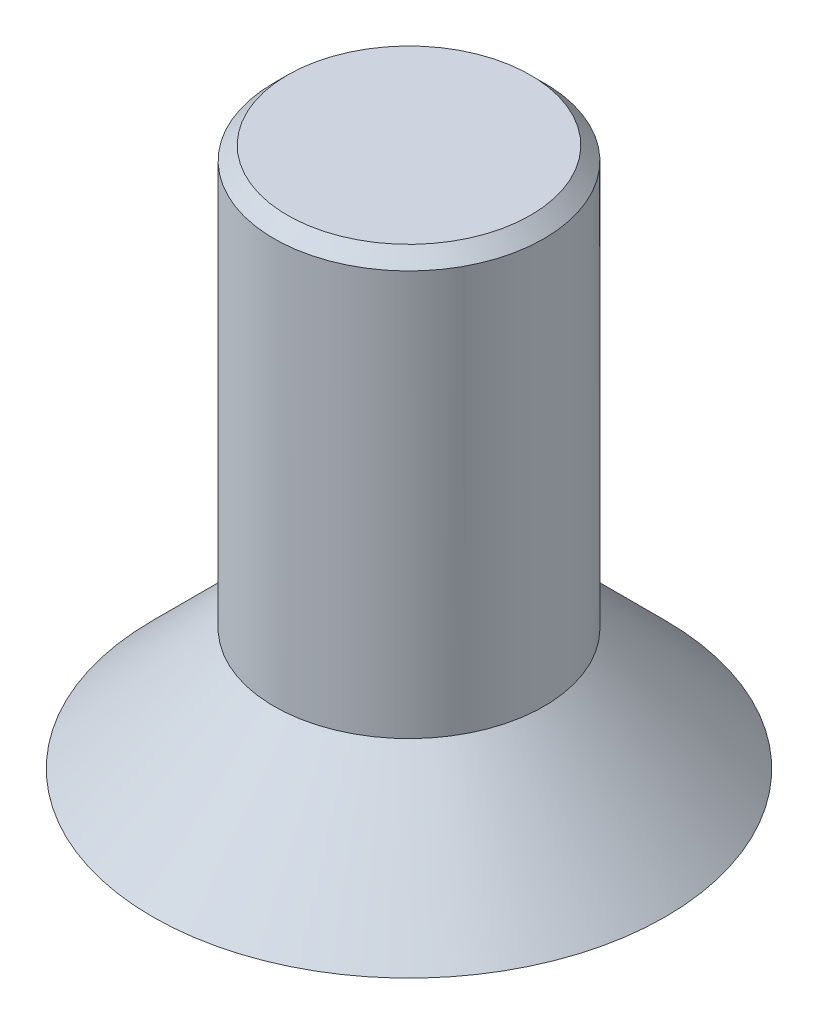
ISO-10303-21;
HEADER;
FILE_DESCRIPTION(('STEP AP214'),'2;1');
FILE_NAME('part.step','',(''),(''),'','','');
FILE_SCHEMA(('AUTOMOTIVE_DESIGN { 1 0 10303 214 1 1 1 1 }'));
ENDSEC;
DATA;
#1=APPLICATION_CONTEXT('core data for automotive mechanical design processes');
#2=APPLICATION_PROTOCOL_DEFINITION('international standard','automotive_design',2000,#1);
#3=PRODUCT_CONTEXT('',#1,'mechanical');
#4=PRODUCT('Part','Part','',(#3));
#5=PRODUCT_RELATED_PRODUCT_CATEGORY('part','',(#4));
#6=PRODUCT_DEFINITION_FORMATION('','',#4);
#7=PRODUCT_DEFINITION_CONTEXT('part definition',#1,'design');
#8=PRODUCT_DEFINITION('design','',#6,#7);
#9=PRODUCT_DEFINITION_SHAPE('','',#8);
#10=(LENGTH_UNIT() NAMED_UNIT(*) SI_UNIT(.MILLI.,.METRE.));
#11=(NAMED_UNIT(*) PLANE_ANGLE_UNIT() SI_UNIT($,.RADIAN.));
#12=(NAMED_UNIT(*) SI_UNIT($,.STERADIAN.) SOLID_ANGLE_UNIT());
#13=UNCERTAINTY_MEASURE_WITH_UNIT(LENGTH_MEASURE(1.E-05),#10,'distance_accuracy_value','');
#14=(GEOMETRIC_REPRESENTATION_CONTEXT(3) GLOBAL_UNCERTAINTY_ASSIGNED_CONTEXT((#13)) GLOBAL_UNIT_ASSIGNED_CONTEXT((#10,
#11,#12)) REPRESENTATION_CONTEXT('',''));
#15=CARTESIAN_POINT('',(0.,0.,0.));
#16=DIRECTION('',(0.,0.,1.));
#17=DIRECTION('',(1.,0.,0.));
#18=AXIS2_PLACEMENT_3D('',#15,#16,#17);
#19=CARTESIAN_POINT('',(0.,0.,0.));
#20=DIRECTION('',(0.,1.,0.));
#21=DIRECTION('',(-1.,0.,0.));
#22=AXIS2_PLACEMENT_3D('',#19,#20,#21);
#23=PLANE('',#22);
#24=DIRECTION('',(-0.012738667916744,0.,0.999918859877994));
#25=VECTOR('',#24,1.);
#26=CARTESIAN_POINT('',(0.755455149921632,0.,-0.423423566251199));
#27=LINE('',#26,#25);
#28=CARTESIAN_POINT('',(0.755455149921632,0.,-0.423423566251199));
#29=VERTEX_POINT('',#28);
#30=CARTESIAN_POINT('',(0.744423139895358,0.,0.442531568126316));
#31=VERTEX_POINT('',#30);
#32=EDGE_CURVE('E124',#29,#31,#27,.T.);
#33=ORIENTED_EDGE('',*,*,#32,.F.);
#34=DIRECTION('',(0.859585800419143,0.,0.510991439965271));
#35=VECTOR('',#34,1.);
#36=CARTESIAN_POINT('',(0.0110320100262732,0.,-0.865955134377515));
#37=LINE('',#36,#35);
#38=CARTESIAN_POINT('',(0.0110320100262732,0.,-0.865955134377515));
#39=VERTEX_POINT('',#38);
#40=EDGE_CURVE('E50',#39,#29,#37,.T.);
#41=ORIENTED_EDGE('',*,*,#40,.F.);
#42=DIRECTION('',(0.872324468335887,0.,-0.488927419912723));
#43=VECTOR('',#42,1.);
#44=CARTESIAN_POINT('',(-0.744423139895358,0.,-0.442531568126316));
#45=LINE('',#44,#43);
#46=CARTESIAN_POINT('',(-0.744423139895358,0.,-0.442531568126316));
#47=VERTEX_POINT('',#46);
#48=EDGE_CURVE('E133',#47,#39,#45,.T.);
#49=ORIENTED_EDGE('',*,*,#48,.F.);
#50=DIRECTION('',(0.0127386679167445,0.,-0.999918859877994));
#51=VECTOR('',#50,1.);
#52=CARTESIAN_POINT('',(-0.755455149921633,0.,0.423423566251199));
#53=LINE('',#52,#51);
#54=CARTESIAN_POINT('',(-0.755455149921633,0.,0.423423566251199));
#55=VERTEX_POINT('',#54);
#56=EDGE_CURVE('E131',#55,#47,#53,.T.);
#57=ORIENTED_EDGE('',*,*,#56,.F.);
#58=DIRECTION('',(-0.859585800419143,0.,-0.510991439965271));
#59=VECTOR('',#58,1.);
#60=CARTESIAN_POINT('',(-0.0110320100262739,0.,0.865955134377515));
#61=LINE('',#60,#59);
#62=CARTESIAN_POINT('',(-0.0110320100262739,0.,0.865955134377515));
#63=VERTEX_POINT('',#62);
#64=EDGE_CURVE('E98',#63,#55,#61,.T.);
#65=ORIENTED_EDGE('',*,*,#64,.F.);
#66=DIRECTION('',(-0.872324468335887,0.,0.488927419912723));
#67=VECTOR('',#66,1.);
#68=CARTESIAN_POINT('',(0.744423139895358,0.,0.442531568126316));
#69=LINE('',#68,#67);
#70=EDGE_CURVE('E127',#31,#63,#69,.T.);
#71=ORIENTED_EDGE('',*,*,#70,.F.);
#72=EDGE_LOOP('',(#33,#41,#49,#57,#65,#71));
#73=FACE_BOUND('',#72,.T.);
#74=CARTESIAN_POINT('',(0.,0.,0.));
#75=DIRECTION('',(0.,1.,0.));
#76=DIRECTION('',(-1.,0.,0.));
#77=AXIS2_PLACEMENT_3D('',#74,#75,#76);
#78=CIRCLE('',#77,1.9);
#79=CARTESIAN_POINT('',(-1.9,0.,0.));
#80=VERTEX_POINT('',#79);
#81=EDGE_CURVE('E145',#80,#80,#78,.T.);
#82=ORIENTED_EDGE('',*,*,#81,.F.);
#83=EDGE_LOOP('',(#82));
#84=FACE_BOUND('',#83,.T.);
#85=ADVANCED_FACE('F34',(#73,#84),#23,.F.);
#86=CARTESIAN_POINT('',(0.,0.,0.));
#87=DIRECTION('',(0.,-1.,0.));
#88=DIRECTION('',(1.,0.,0.));
#89=AXIS2_PLACEMENT_3D('',#86,#87,#88);
#90=CONICAL_SURFACE('',#89,1.9,0.785398163397454);
#91=CARTESIAN_POINT('',(0.,0.89999999999999,0.));
#92=DIRECTION('',(0.,1.,0.));
#93=DIRECTION('',(-1.,0.,0.));
#94=AXIS2_PLACEMENT_3D('',#91,#92,#93);
#95=CIRCLE('',#94,1.);
#96=CARTESIAN_POINT('',(-1.,0.89999999999999,0.));
#97=VERTEX_POINT('',#96);
#98=EDGE_CURVE('E137',#97,#97,#95,.T.);
#99=ORIENTED_EDGE('',*,*,#98,.F.);
#100=EDGE_LOOP('',(#99));
#101=FACE_BOUND('',#100,.T.);
#102=ORIENTED_EDGE('',*,*,#81,.T.);
#103=EDGE_LOOP('',(#102));
#104=FACE_BOUND('',#103,.T.);
#105=ADVANCED_FACE('F161',(#101,#104),#90,.T.);
#106=CARTESIAN_POINT('',(0.,4.,0.));
#107=DIRECTION('',(0.,1.,0.));
#108=DIRECTION('',(-1.,0.,0.));
#109=AXIS2_PLACEMENT_3D('',#106,#107,#108);
#110=CYLINDRICAL_SURFACE('',#109,1.);
#111=CARTESIAN_POINT('',(0.,3.9,0.));
#112=DIRECTION('',(0.,-1.,0.));
#113=DIRECTION('',(1.,0.,0.));
#114=AXIS2_PLACEMENT_3D('',#111,#112,#113);
#115=CIRCLE('',#114,1.);
#116=CARTESIAN_POINT('',(1.,3.9,0.));
#117=VERTEX_POINT('',#116);
#118=EDGE_CURVE('E11',#117,#117,#115,.T.);
#119=ORIENTED_EDGE('',*,*,#118,.T.);
#120=EDGE_LOOP('',(#119));
#121=FACE_BOUND('',#120,.T.);
#122=ORIENTED_EDGE('',*,*,#98,.T.);
#123=EDGE_LOOP('',(#122));
#124=FACE_BOUND('',#123,.T.);
#125=ADVANCED_FACE('F166',(#121,#124),#110,.T.);
#126=CARTESIAN_POINT('',(1.,4.,0.));
#127=DIRECTION('',(0.,-1.,0.));
#128=DIRECTION('',(1.,0.,0.));
#129=AXIS2_PLACEMENT_3D('',#126,#127,#128);
#130=PLANE('',#129);
#131=CARTESIAN_POINT('',(0.,4.,0.));
#132=DIRECTION('',(0.,-1.,0.));
#133=DIRECTION('',(1.,0.,0.));
#134=AXIS2_PLACEMENT_3D('',#131,#132,#133);
#135=CIRCLE('',#134,0.9);
#136=CARTESIAN_POINT('',(0.9,4.,0.));
#137=VERTEX_POINT('',#136);
#138=EDGE_CURVE('E43',#137,#137,#135,.F.);
#139=ORIENTED_EDGE('',*,*,#138,.T.);
#140=EDGE_LOOP('',(#139));
#141=FACE_BOUND('',#140,.T.);
#142=ADVANCED_FACE('F150',(#141),#130,.F.);
#143=CARTESIAN_POINT('',(0.0110320100262732,1.,-0.865955134377515));
#144=DIRECTION('',(0.510991439965271,0.,-0.859585800419143));
#145=DIRECTION('',(-0.859585800419143,0.,-0.510991439965271));
#146=AXIS2_PLACEMENT_3D('',#143,#144,#145);
#147=PLANE('',#146);
#148=ORIENTED_EDGE('',*,*,#40,.T.);
#149=DIRECTION('',(0.,-1.,0.));
#150=VECTOR('',#149,1.);
#151=CARTESIAN_POINT('',(0.755455149921632,1.,-0.423423566251199));
#152=LINE('',#151,#150);
#153=CARTESIAN_POINT('',(0.755455149921632,1.,-0.423423566251199));
#154=VERTEX_POINT('',#153);
#155=EDGE_CURVE('E80',#154,#29,#152,.T.);
#156=ORIENTED_EDGE('',*,*,#155,.F.);
#157=DIRECTION('',(0.859585800419143,0.,0.510991439965271));
#158=VECTOR('',#157,1.);
#159=CARTESIAN_POINT('',(0.0110320100262732,1.,-0.865955134377515));
#160=LINE('',#159,#158);
#161=CARTESIAN_POINT('',(0.0110320100262732,1.,-0.865955134377515));
#162=VERTEX_POINT('',#161);
#163=EDGE_CURVE('E135',#162,#154,#160,.T.);
#164=ORIENTED_EDGE('',*,*,#163,.F.);
#165=DIRECTION('',(0.,-1.,0.));
#166=VECTOR('',#165,1.);
#167=CARTESIAN_POINT('',(0.0110320100262732,1.,-0.865955134377515));
#168=LINE('',#167,#166);
#169=EDGE_CURVE('E58',#162,#39,#168,.T.);
#170=ORIENTED_EDGE('',*,*,#169,.T.);
#171=EDGE_LOOP('',(#148,#156,#164,#170));
#172=FACE_BOUND('',#171,.T.);
#173=ADVANCED_FACE('F177',(#172),#147,.F.);
#174=CARTESIAN_POINT('',(-0.744423139895358,1.,-0.442531568126316));
#175=DIRECTION('',(-0.488927419912723,0.,-0.872324468335887));
#176=DIRECTION('',(-0.872324468335887,0.,0.488927419912723));
#177=AXIS2_PLACEMENT_3D('',#174,#175,#176);
#178=PLANE('',#177);
#179=ORIENTED_EDGE('',*,*,#48,.T.);
#180=ORIENTED_EDGE('',*,*,#169,.F.);
#181=DIRECTION('',(0.872324468335887,0.,-0.488927419912723));
#182=VECTOR('',#181,1.);
#183=CARTESIAN_POINT('',(-0.744423139895358,1.,-0.442531568126316));
#184=LINE('',#183,#182);
#185=CARTESIAN_POINT('',(-0.744423139895358,1.,-0.442531568126316));
#186=VERTEX_POINT('',#185);
#187=EDGE_CURVE('E110',#186,#162,#184,.T.);
#188=ORIENTED_EDGE('',*,*,#187,.F.);
#189=DIRECTION('',(0.,-1.,0.));
#190=VECTOR('',#189,1.);
#191=CARTESIAN_POINT('',(-0.744423139895358,1.,-0.442531568126316));
#192=LINE('',#191,#190);
#193=EDGE_CURVE('E102',#186,#47,#192,.T.);
#194=ORIENTED_EDGE('',*,*,#193,.T.);
#195=EDGE_LOOP('',(#179,#180,#188,#194));
#196=FACE_BOUND('',#195,.T.);
#197=ADVANCED_FACE('F180',(#196),#178,.F.);
#198=CARTESIAN_POINT('',(-0.755455149921633,1.,0.423423566251199));
#199=DIRECTION('',(-0.999918859877994,0.,-0.0127386679167445));
#200=DIRECTION('',(-0.0127386679167445,0.,0.999918859877994));
#201=AXIS2_PLACEMENT_3D('',#198,#199,#200);
#202=PLANE('',#201);
#203=ORIENTED_EDGE('',*,*,#56,.T.);
#204=ORIENTED_EDGE('',*,*,#193,.F.);
#205=DIRECTION('',(0.0127386679167445,0.,-0.999918859877994));
#206=VECTOR('',#205,1.);
#207=CARTESIAN_POINT('',(-0.755455149921633,1.,0.423423566251199));
#208=LINE('',#207,#206);
#209=CARTESIAN_POINT('',(-0.755455149921633,1.,0.423423566251199));
#210=VERTEX_POINT('',#209);
#211=EDGE_CURVE('E106',#210,#186,#208,.T.);
#212=ORIENTED_EDGE('',*,*,#211,.F.);
#213=DIRECTION('',(0.,-1.,0.));
#214=VECTOR('',#213,1.);
#215=CARTESIAN_POINT('',(-0.755455149921633,1.,0.423423566251199));
#216=LINE('',#215,#214);
#217=EDGE_CURVE('E91',#210,#55,#216,.T.);
#218=ORIENTED_EDGE('',*,*,#217,.T.);
#219=EDGE_LOOP('',(#203,#204,#212,#218));
#220=FACE_BOUND('',#219,.T.);
#221=ADVANCED_FACE('F107',(#220),#202,.F.);
#222=CARTESIAN_POINT('',(-0.0110320100262739,1.,0.865955134377515));
#223=DIRECTION('',(-0.510991439965271,0.,0.859585800419143));
#224=DIRECTION('',(0.859585800419143,0.,0.510991439965271));
#225=AXIS2_PLACEMENT_3D('',#222,#223,#224);
#226=PLANE('',#225);
#227=ORIENTED_EDGE('',*,*,#64,.T.);
#228=ORIENTED_EDGE('',*,*,#217,.F.);
#229=DIRECTION('',(-0.859585800419143,0.,-0.510991439965271));
#230=VECTOR('',#229,1.);
#231=CARTESIAN_POINT('',(-0.0110320100262739,1.,0.865955134377515));
#232=LINE('',#231,#230);
#233=CARTESIAN_POINT('',(-0.0110320100262739,1.,0.865955134377515));
#234=VERTEX_POINT('',#233);
#235=EDGE_CURVE('E95',#234,#210,#232,.T.);
#236=ORIENTED_EDGE('',*,*,#235,.F.);
#237=DIRECTION('',(0.,-1.,0.));
#238=VECTOR('',#237,1.);
#239=CARTESIAN_POINT('',(-0.0110320100262739,1.,0.865955134377515));
#240=LINE('',#239,#238);
#241=EDGE_CURVE('E103',#234,#63,#240,.T.);
#242=ORIENTED_EDGE('',*,*,#241,.T.);
#243=EDGE_LOOP('',(#227,#228,#236,#242));
#244=FACE_BOUND('',#243,.T.);
#245=ADVANCED_FACE('F93',(#244),#226,.F.);
#246=CARTESIAN_POINT('',(0.744423139895358,1.,0.442531568126316));
#247=DIRECTION('',(0.488927419912723,0.,0.872324468335887));
#248=DIRECTION('',(0.872324468335887,0.,-0.488927419912723));
#249=AXIS2_PLACEMENT_3D('',#246,#247,#248);
#250=PLANE('',#249);
#251=ORIENTED_EDGE('',*,*,#70,.T.);
#252=ORIENTED_EDGE('',*,*,#241,.F.);
#253=DIRECTION('',(-0.872324468335887,0.,0.488927419912723));
#254=VECTOR('',#253,1.);
#255=CARTESIAN_POINT('',(0.744423139895358,1.,0.442531568126316));
#256=LINE('',#255,#254);
#257=CARTESIAN_POINT('',(0.744423139895358,1.,0.442531568126316));
#258=VERTEX_POINT('',#257);
#259=EDGE_CURVE('E116',#258,#234,#256,.T.);
#260=ORIENTED_EDGE('',*,*,#259,.F.);
#261=DIRECTION('',(0.,-1.,0.));
#262=VECTOR('',#261,1.);
#263=CARTESIAN_POINT('',(0.744423139895358,1.,0.442531568126316));
#264=LINE('',#263,#262);
#265=EDGE_CURVE('E140',#258,#31,#264,.T.);
#266=ORIENTED_EDGE('',*,*,#265,.T.);
#267=EDGE_LOOP('',(#251,#252,#260,#266));
#268=FACE_BOUND('',#267,.T.);
#269=ADVANCED_FACE('F183',(#268),#250,.F.);
#270=CARTESIAN_POINT('',(0.755455149921632,1.,-0.423423566251199));
#271=DIRECTION('',(0.999918859877994,0.,0.012738667916744));
#272=DIRECTION('',(0.012738667916744,0.,-0.999918859877994));
#273=AXIS2_PLACEMENT_3D('',#270,#271,#272);
#274=PLANE('',#273);
#275=ORIENTED_EDGE('',*,*,#32,.T.);
#276=ORIENTED_EDGE('',*,*,#265,.F.);
#277=DIRECTION('',(-0.012738667916744,0.,0.999918859877994));
#278=VECTOR('',#277,1.);
#279=CARTESIAN_POINT('',(0.755455149921632,1.,-0.423423566251199));
#280=LINE('',#279,#278);
#281=EDGE_CURVE('E118',#154,#258,#280,.T.);
#282=ORIENTED_EDGE('',*,*,#281,.F.);
#283=ORIENTED_EDGE('',*,*,#155,.T.);
#284=EDGE_LOOP('',(#275,#276,#282,#283));
#285=FACE_BOUND('',#284,.T.);
#286=ADVANCED_FACE('F157',(#285),#274,.F.);
#287=CARTESIAN_POINT('',(0.,1.,0.));
#288=DIRECTION('',(0.,-1.,0.));
#289=DIRECTION('',(1.,0.,0.));
#290=AXIS2_PLACEMENT_3D('',#287,#288,#289);
#291=PLANE('',#290);
#292=ORIENTED_EDGE('',*,*,#163,.T.);
#293=ORIENTED_EDGE('',*,*,#281,.T.);
#294=ORIENTED_EDGE('',*,*,#259,.T.);
#295=ORIENTED_EDGE('',*,*,#235,.T.);
#296=ORIENTED_EDGE('',*,*,#211,.T.);
#297=ORIENTED_EDGE('',*,*,#187,.T.);
#298=EDGE_LOOP('',(#292,#293,#294,#295,#296,#297));
#299=FACE_BOUND('',#298,.T.);
#300=ADVANCED_FACE('F113',(#299),#291,.T.);
#301=CARTESIAN_POINT('',(0.,4.,0.));
#302=DIRECTION('',(0.,-1.,0.));
#303=DIRECTION('',(1.,0.,0.));
#304=AXIS2_PLACEMENT_3D('',#301,#302,#303);
#305=CONICAL_SURFACE('',#304,0.9,0.78539816339744);
#306=ORIENTED_EDGE('',*,*,#118,.F.);
#307=EDGE_LOOP('',(#306));
#308=FACE_BOUND('',#307,.T.);
#309=ORIENTED_EDGE('',*,*,#138,.F.);
#310=EDGE_LOOP('',(#309));
#311=FACE_BOUND('',#310,.T.);
#312=ADVANCED_FACE('F37',(#308,#311),#305,.T.);
#313=CLOSED_SHELL('',(#85,#105,#125,#142,#173,#197,#221,#245,#269,#286,#300,#312));
#314=MANIFOLD_SOLID_BREP('B2',#313);
#315=ADVANCED_BREP_SHAPE_REPRESENTATION('',(#18,#314),#14);
#316=SHAPE_DEFINITION_REPRESENTATION(#9,#315);
ENDSEC;
END-ISO-10303-21;
